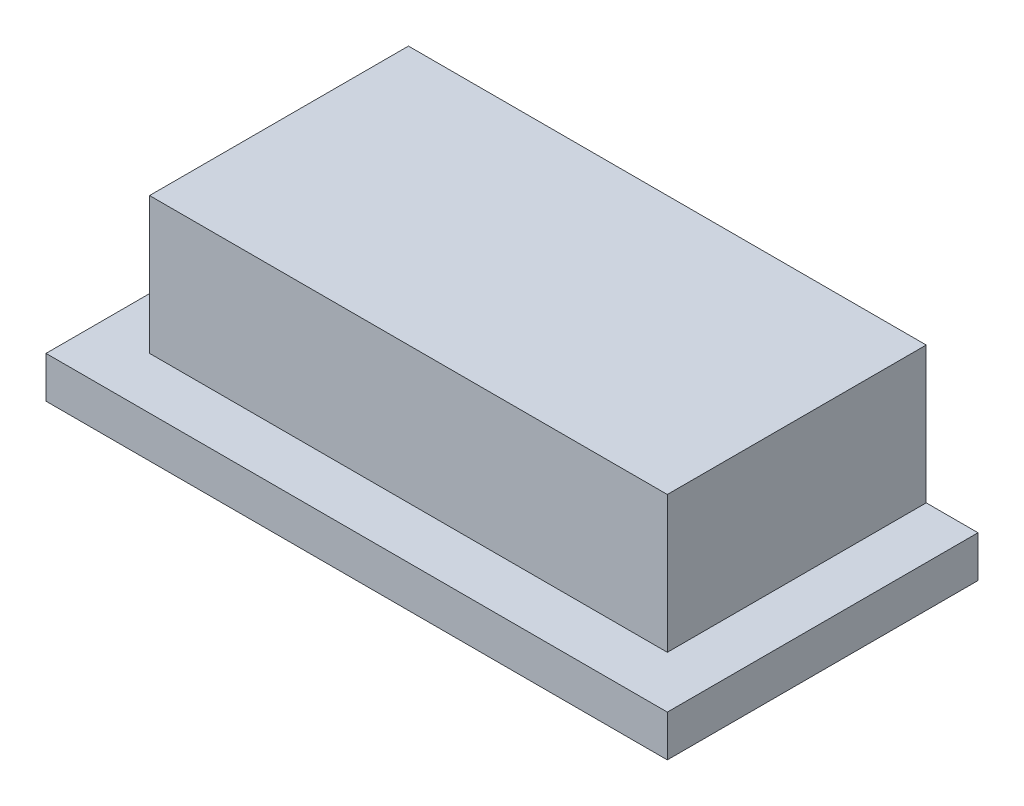
ISO-10303-21;
HEADER;
FILE_DESCRIPTION(('STEP AP214'),'2;1');
FILE_NAME('part.step','',(''),(''),'','','');
FILE_SCHEMA(('AUTOMOTIVE_DESIGN { 1 0 10303 214 1 1 1 1 }'));
ENDSEC;
DATA;
#1=APPLICATION_CONTEXT('core data for automotive mechanical design processes');
#2=APPLICATION_PROTOCOL_DEFINITION('international standard','automotive_design',2000,#1);
#3=PRODUCT_CONTEXT('',#1,'mechanical');
#4=PRODUCT('Part','Part','',(#3));
#5=PRODUCT_RELATED_PRODUCT_CATEGORY('part','',(#4));
#6=PRODUCT_DEFINITION_FORMATION('','',#4);
#7=PRODUCT_DEFINITION_CONTEXT('part definition',#1,'design');
#8=PRODUCT_DEFINITION('design','',#6,#7);
#9=PRODUCT_DEFINITION_SHAPE('','',#8);
#10=(LENGTH_UNIT() NAMED_UNIT(*) SI_UNIT(.MILLI.,.METRE.));
#11=(NAMED_UNIT(*) PLANE_ANGLE_UNIT() SI_UNIT($,.RADIAN.));
#12=(NAMED_UNIT(*) SI_UNIT($,.STERADIAN.) SOLID_ANGLE_UNIT());
#13=UNCERTAINTY_MEASURE_WITH_UNIT(LENGTH_MEASURE(1.E-05),#10,'distance_accuracy_value','');
#14=(GEOMETRIC_REPRESENTATION_CONTEXT(3) GLOBAL_UNCERTAINTY_ASSIGNED_CONTEXT((#13)) GLOBAL_UNIT_ASSIGNED_CONTEXT((#10,
#11,#12)) REPRESENTATION_CONTEXT('',''));
#15=CARTESIAN_POINT('',(0.,0.,0.));
#16=DIRECTION('',(0.,0.,1.));
#17=DIRECTION('',(1.,0.,0.));
#18=AXIS2_PLACEMENT_3D('',#15,#16,#17);
#19=CARTESIAN_POINT('',(0.,40.,0.));
#20=DIRECTION('',(0.,-1.,0.));
#21=DIRECTION('',(0.,0.,-1.));
#22=AXIS2_PLACEMENT_3D('',#19,#20,#21);
#23=PLANE('',#22);
#24=DIRECTION('',(0.,0.,1.));
#25=VECTOR('',#24,1.);
#26=CARTESIAN_POINT('',(-250.,40.,-197.243006580971));
#27=LINE('',#26,#25);
#28=CARTESIAN_POINT('',(-250.,40.,-197.243006580971));
#29=VERTEX_POINT('',#28);
#30=CARTESIAN_POINT('',(-250.,40.,52.7569934190289));
#31=VERTEX_POINT('',#30);
#32=EDGE_CURVE('E55',#29,#31,#27,.T.);
#33=ORIENTED_EDGE('',*,*,#32,.F.);
#34=DIRECTION('',(-1.,0.,0.));
#35=VECTOR('',#34,1.);
#36=CARTESIAN_POINT('',(300.,40.,-197.243006580971));
#37=LINE('',#36,#35);
#38=CARTESIAN_POINT('',(-300.,40.,-197.243006580971));
#39=VERTEX_POINT('',#38);
#40=EDGE_CURVE('E137',#29,#39,#37,.T.);
#41=ORIENTED_EDGE('',*,*,#40,.T.);
#42=DIRECTION('',(0.,0.,1.));
#43=VECTOR('',#42,1.);
#44=CARTESIAN_POINT('',(-300.,40.,-197.243006580971));
#45=LINE('',#44,#43);
#46=CARTESIAN_POINT('',(-300.,40.,102.756993419029));
#47=VERTEX_POINT('',#46);
#48=EDGE_CURVE('E129',#39,#47,#45,.T.);
#49=ORIENTED_EDGE('',*,*,#48,.T.);
#50=DIRECTION('',(1.,0.,0.));
#51=VECTOR('',#50,1.);
#52=CARTESIAN_POINT('',(300.,40.,102.756993419029));
#53=LINE('',#52,#51);
#54=CARTESIAN_POINT('',(300.,40.,102.756993419029));
#55=VERTEX_POINT('',#54);
#56=EDGE_CURVE('E132',#47,#55,#53,.T.);
#57=ORIENTED_EDGE('',*,*,#56,.T.);
#58=DIRECTION('',(0.,0.,-1.));
#59=VECTOR('',#58,1.);
#60=CARTESIAN_POINT('',(300.,40.,-197.243006580971));
#61=LINE('',#60,#59);
#62=CARTESIAN_POINT('',(300.,40.,-197.243006580971));
#63=VERTEX_POINT('',#62);
#64=EDGE_CURVE('E135',#55,#63,#61,.T.);
#65=ORIENTED_EDGE('',*,*,#64,.T.);
#66=CARTESIAN_POINT('',(250.,40.,-197.243006580971));
#67=VERTEX_POINT('',#66);
#68=EDGE_CURVE('E138',#63,#67,#37,.T.);
#69=ORIENTED_EDGE('',*,*,#68,.T.);
#70=DIRECTION('',(0.,0.,-1.));
#71=VECTOR('',#70,1.);
#72=CARTESIAN_POINT('',(250.,40.,-197.243006580971));
#73=LINE('',#72,#71);
#74=CARTESIAN_POINT('',(250.,40.,52.7569934190289));
#75=VERTEX_POINT('',#74);
#76=EDGE_CURVE('E117',#75,#67,#73,.T.);
#77=ORIENTED_EDGE('',*,*,#76,.F.);
#78=DIRECTION('',(1.,0.,0.));
#79=VECTOR('',#78,1.);
#80=CARTESIAN_POINT('',(-250.,40.,52.7569934190289));
#81=LINE('',#80,#79);
#82=EDGE_CURVE('E50',#31,#75,#81,.T.);
#83=ORIENTED_EDGE('',*,*,#82,.F.);
#84=EDGE_LOOP('',(#33,#41,#49,#57,#65,#69,#77,#83));
#85=FACE_BOUND('',#84,.T.);
#86=ADVANCED_FACE('F35',(#85),#23,.F.);
#87=CARTESIAN_POINT('',(-300.,40.,-197.243006580971));
#88=DIRECTION('',(1.,0.,0.));
#89=DIRECTION('',(0.,0.,-1.));
#90=AXIS2_PLACEMENT_3D('',#87,#88,#89);
#91=PLANE('',#90);
#92=DIRECTION('',(0.,0.,1.));
#93=VECTOR('',#92,1.);
#94=CARTESIAN_POINT('',(-300.,0.,-197.243006580971));
#95=LINE('',#94,#93);
#96=CARTESIAN_POINT('',(-300.,0.,-197.243006580971));
#97=VERTEX_POINT('',#96);
#98=CARTESIAN_POINT('',(-300.,0.,102.756993419029));
#99=VERTEX_POINT('',#98);
#100=EDGE_CURVE('E120',#97,#99,#95,.T.);
#101=ORIENTED_EDGE('',*,*,#100,.T.);
#102=DIRECTION('',(0.,-1.,0.));
#103=VECTOR('',#102,1.);
#104=CARTESIAN_POINT('',(-300.,40.,102.756993419029));
#105=LINE('',#104,#103);
#106=EDGE_CURVE('E11',#47,#99,#105,.T.);
#107=ORIENTED_EDGE('',*,*,#106,.F.);
#108=ORIENTED_EDGE('',*,*,#48,.F.);
#109=DIRECTION('',(0.,-1.,0.));
#110=VECTOR('',#109,1.);
#111=CARTESIAN_POINT('',(-300.,40.,-197.243006580971));
#112=LINE('',#111,#110);
#113=EDGE_CURVE('E139',#39,#97,#112,.T.);
#114=ORIENTED_EDGE('',*,*,#113,.T.);
#115=EDGE_LOOP('',(#101,#107,#108,#114));
#116=FACE_BOUND('',#115,.T.);
#117=ADVANCED_FACE('F37',(#116),#91,.F.);
#118=CARTESIAN_POINT('',(300.,40.,102.756993419029));
#119=DIRECTION('',(0.,0.,-1.));
#120=DIRECTION('',(-1.,0.,0.));
#121=AXIS2_PLACEMENT_3D('',#118,#119,#120);
#122=PLANE('',#121);
#123=DIRECTION('',(1.,0.,0.));
#124=VECTOR('',#123,1.);
#125=CARTESIAN_POINT('',(300.,0.,102.756993419029));
#126=LINE('',#125,#124);
#127=CARTESIAN_POINT('',(300.,0.,102.756993419029));
#128=VERTEX_POINT('',#127);
#129=EDGE_CURVE('E123',#99,#128,#126,.T.);
#130=ORIENTED_EDGE('',*,*,#129,.T.);
#131=DIRECTION('',(0.,-1.,0.));
#132=VECTOR('',#131,1.);
#133=CARTESIAN_POINT('',(300.,40.,102.756993419029));
#134=LINE('',#133,#132);
#135=EDGE_CURVE('E43',#55,#128,#134,.T.);
#136=ORIENTED_EDGE('',*,*,#135,.F.);
#137=ORIENTED_EDGE('',*,*,#56,.F.);
#138=ORIENTED_EDGE('',*,*,#106,.T.);
#139=EDGE_LOOP('',(#130,#136,#137,#138));
#140=FACE_BOUND('',#139,.T.);
#141=ADVANCED_FACE('F193',(#140),#122,.F.);
#142=CARTESIAN_POINT('',(300.,40.,-197.243006580971));
#143=DIRECTION('',(-1.,0.,0.));
#144=DIRECTION('',(0.,0.,1.));
#145=AXIS2_PLACEMENT_3D('',#142,#143,#144);
#146=PLANE('',#145);
#147=DIRECTION('',(0.,0.,-1.));
#148=VECTOR('',#147,1.);
#149=CARTESIAN_POINT('',(300.,0.,-197.243006580971));
#150=LINE('',#149,#148);
#151=CARTESIAN_POINT('',(300.,0.,-197.243006580971));
#152=VERTEX_POINT('',#151);
#153=EDGE_CURVE('E142',#128,#152,#150,.T.);
#154=ORIENTED_EDGE('',*,*,#153,.T.);
#155=DIRECTION('',(0.,-1.,0.));
#156=VECTOR('',#155,1.);
#157=CARTESIAN_POINT('',(300.,40.,-197.243006580971));
#158=LINE('',#157,#156);
#159=EDGE_CURVE('E147',#63,#152,#158,.T.);
#160=ORIENTED_EDGE('',*,*,#159,.F.);
#161=ORIENTED_EDGE('',*,*,#64,.F.);
#162=ORIENTED_EDGE('',*,*,#135,.T.);
#163=EDGE_LOOP('',(#154,#160,#161,#162));
#164=FACE_BOUND('',#163,.T.);
#165=ADVANCED_FACE('F154',(#164),#146,.F.);
#166=CARTESIAN_POINT('',(300.,40.,-197.243006580971));
#167=DIRECTION('',(0.,0.,1.));
#168=DIRECTION('',(1.,0.,0.));
#169=AXIS2_PLACEMENT_3D('',#166,#167,#168);
#170=PLANE('',#169);
#171=DIRECTION('',(-1.,0.,0.));
#172=VECTOR('',#171,1.);
#173=CARTESIAN_POINT('',(300.,0.,-197.243006580971));
#174=LINE('',#173,#172);
#175=EDGE_CURVE('E133',#152,#97,#174,.T.);
#176=ORIENTED_EDGE('',*,*,#175,.T.);
#177=ORIENTED_EDGE('',*,*,#113,.F.);
#178=ORIENTED_EDGE('',*,*,#40,.F.);
#179=DIRECTION('',(0.,-1.,0.));
#180=VECTOR('',#179,1.);
#181=CARTESIAN_POINT('',(-250.,172.,-197.243006580971));
#182=LINE('',#181,#180);
#183=CARTESIAN_POINT('',(-250.,172.,-197.243006580971));
#184=VERTEX_POINT('',#183);
#185=EDGE_CURVE('E168',#184,#29,#182,.T.);
#186=ORIENTED_EDGE('',*,*,#185,.F.);
#187=DIRECTION('',(-1.,0.,0.));
#188=VECTOR('',#187,1.);
#189=CARTESIAN_POINT('',(-250.,172.,-197.243006580971));
#190=LINE('',#189,#188);
#191=CARTESIAN_POINT('',(250.,172.,-197.243006580971));
#192=VERTEX_POINT('',#191);
#193=EDGE_CURVE('E113',#192,#184,#190,.T.);
#194=ORIENTED_EDGE('',*,*,#193,.F.);
#195=DIRECTION('',(0.,-1.,0.));
#196=VECTOR('',#195,1.);
#197=CARTESIAN_POINT('',(250.,172.,-197.243006580971));
#198=LINE('',#197,#196);
#199=EDGE_CURVE('E125',#192,#67,#198,.T.);
#200=ORIENTED_EDGE('',*,*,#199,.T.);
#201=ORIENTED_EDGE('',*,*,#68,.F.);
#202=ORIENTED_EDGE('',*,*,#159,.T.);
#203=EDGE_LOOP('',(#176,#177,#178,#186,#194,#200,#201,#202));
#204=FACE_BOUND('',#203,.T.);
#205=ADVANCED_FACE('F163',(#204),#170,.F.);
#206=CARTESIAN_POINT('',(0.,0.,0.));
#207=DIRECTION('',(0.,-1.,0.));
#208=DIRECTION('',(0.,0.,-1.));
#209=AXIS2_PLACEMENT_3D('',#206,#207,#208);
#210=PLANE('',#209);
#211=ORIENTED_EDGE('',*,*,#100,.F.);
#212=ORIENTED_EDGE('',*,*,#175,.F.);
#213=ORIENTED_EDGE('',*,*,#153,.F.);
#214=ORIENTED_EDGE('',*,*,#129,.F.);
#215=EDGE_LOOP('',(#211,#212,#213,#214));
#216=FACE_BOUND('',#215,.T.);
#217=ADVANCED_FACE('F160',(#216),#210,.T.);
#218=CARTESIAN_POINT('',(-250.,172.,-197.243006580971));
#219=DIRECTION('',(1.,0.,0.));
#220=DIRECTION('',(0.,0.,-1.));
#221=AXIS2_PLACEMENT_3D('',#218,#219,#220);
#222=PLANE('',#221);
#223=ORIENTED_EDGE('',*,*,#32,.T.);
#224=DIRECTION('',(0.,-1.,0.));
#225=VECTOR('',#224,1.);
#226=CARTESIAN_POINT('',(-250.,172.,52.7569934190289));
#227=LINE('',#226,#225);
#228=CARTESIAN_POINT('',(-250.,172.,52.7569934190289));
#229=VERTEX_POINT('',#228);
#230=EDGE_CURVE('E102',#229,#31,#227,.T.);
#231=ORIENTED_EDGE('',*,*,#230,.F.);
#232=DIRECTION('',(0.,0.,1.));
#233=VECTOR('',#232,1.);
#234=CARTESIAN_POINT('',(-250.,172.,-197.243006580971));
#235=LINE('',#234,#233);
#236=EDGE_CURVE('E108',#184,#229,#235,.T.);
#237=ORIENTED_EDGE('',*,*,#236,.F.);
#238=ORIENTED_EDGE('',*,*,#185,.T.);
#239=EDGE_LOOP('',(#223,#231,#237,#238));
#240=FACE_BOUND('',#239,.T.);
#241=ADVANCED_FACE('F119',(#240),#222,.F.);
#242=CARTESIAN_POINT('',(-250.,172.,52.7569934190289));
#243=DIRECTION('',(0.,0.,-1.));
#244=DIRECTION('',(-1.,0.,0.));
#245=AXIS2_PLACEMENT_3D('',#242,#243,#244);
#246=PLANE('',#245);
#247=ORIENTED_EDGE('',*,*,#82,.T.);
#248=DIRECTION('',(0.,-1.,0.));
#249=VECTOR('',#248,1.);
#250=CARTESIAN_POINT('',(250.,172.,52.7569934190289));
#251=LINE('',#250,#249);
#252=CARTESIAN_POINT('',(250.,172.,52.7569934190289));
#253=VERTEX_POINT('',#252);
#254=EDGE_CURVE('E104',#253,#75,#251,.T.);
#255=ORIENTED_EDGE('',*,*,#254,.F.);
#256=DIRECTION('',(1.,0.,0.));
#257=VECTOR('',#256,1.);
#258=CARTESIAN_POINT('',(-250.,172.,52.7569934190289));
#259=LINE('',#258,#257);
#260=EDGE_CURVE('E98',#229,#253,#259,.T.);
#261=ORIENTED_EDGE('',*,*,#260,.F.);
#262=ORIENTED_EDGE('',*,*,#230,.T.);
#263=EDGE_LOOP('',(#247,#255,#261,#262));
#264=FACE_BOUND('',#263,.T.);
#265=ADVANCED_FACE('F100',(#264),#246,.F.);
#266=CARTESIAN_POINT('',(250.,172.,-197.243006580971));
#267=DIRECTION('',(-1.,0.,0.));
#268=DIRECTION('',(0.,0.,1.));
#269=AXIS2_PLACEMENT_3D('',#266,#267,#268);
#270=PLANE('',#269);
#271=ORIENTED_EDGE('',*,*,#76,.T.);
#272=ORIENTED_EDGE('',*,*,#199,.F.);
#273=DIRECTION('',(0.,0.,-1.));
#274=VECTOR('',#273,1.);
#275=CARTESIAN_POINT('',(250.,172.,-197.243006580971));
#276=LINE('',#275,#274);
#277=EDGE_CURVE('E107',#253,#192,#276,.T.);
#278=ORIENTED_EDGE('',*,*,#277,.F.);
#279=ORIENTED_EDGE('',*,*,#254,.T.);
#280=EDGE_LOOP('',(#271,#272,#278,#279));
#281=FACE_BOUND('',#280,.T.);
#282=ADVANCED_FACE('F179',(#281),#270,.F.);
#283=CARTESIAN_POINT('',(0.,172.,0.));
#284=DIRECTION('',(0.,1.,0.));
#285=DIRECTION('',(0.,0.,1.));
#286=AXIS2_PLACEMENT_3D('',#283,#284,#285);
#287=PLANE('',#286);
#288=ORIENTED_EDGE('',*,*,#236,.T.);
#289=ORIENTED_EDGE('',*,*,#260,.T.);
#290=ORIENTED_EDGE('',*,*,#277,.T.);
#291=ORIENTED_EDGE('',*,*,#193,.T.);
#292=EDGE_LOOP('',(#288,#289,#290,#291));
#293=FACE_BOUND('',#292,.T.);
#294=ADVANCED_FACE('F111',(#293),#287,.T.);
#295=CLOSED_SHELL('',(#86,#117,#141,#165,#205,#217,#241,#265,#282,#294));
#296=MANIFOLD_SOLID_BREP('B2',#295);
#297=ADVANCED_BREP_SHAPE_REPRESENTATION('',(#18,#296),#14);
#298=SHAPE_DEFINITION_REPRESENTATION(#9,#297);
ENDSEC;
END-ISO-10303-21;
